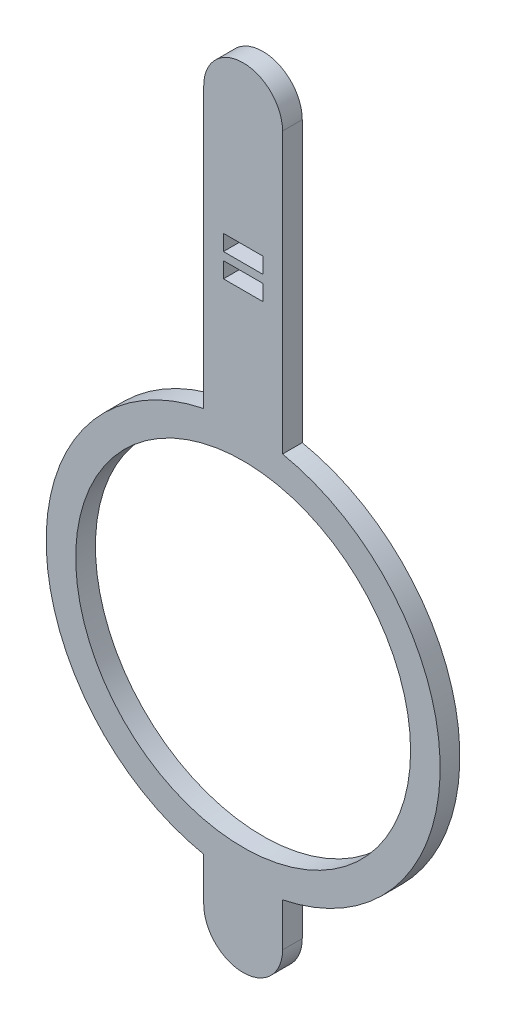
ISO-10303-21;
HEADER;
FILE_DESCRIPTION(('STEP AP214'),'2;1');
FILE_NAME('part.step','',(''),(''),'','','');
FILE_SCHEMA(('AUTOMOTIVE_DESIGN { 1 0 10303 214 1 1 1 1 }'));
ENDSEC;
DATA;
#1=APPLICATION_CONTEXT('core data for automotive mechanical design processes');
#2=APPLICATION_PROTOCOL_DEFINITION('international standard','automotive_design',2000,#1);
#3=PRODUCT_CONTEXT('',#1,'mechanical');
#4=PRODUCT('Part','Part','',(#3));
#5=PRODUCT_RELATED_PRODUCT_CATEGORY('part','',(#4));
#6=PRODUCT_DEFINITION_FORMATION('','',#4);
#7=PRODUCT_DEFINITION_CONTEXT('part definition',#1,'design');
#8=PRODUCT_DEFINITION('design','',#6,#7);
#9=PRODUCT_DEFINITION_SHAPE('','',#8);
#10=(LENGTH_UNIT() NAMED_UNIT(*) SI_UNIT(.MILLI.,.METRE.));
#11=(NAMED_UNIT(*) PLANE_ANGLE_UNIT() SI_UNIT($,.RADIAN.));
#12=(NAMED_UNIT(*) SI_UNIT($,.STERADIAN.) SOLID_ANGLE_UNIT());
#13=UNCERTAINTY_MEASURE_WITH_UNIT(LENGTH_MEASURE(1.E-05),#10,'distance_accuracy_value','');
#14=(GEOMETRIC_REPRESENTATION_CONTEXT(3) GLOBAL_UNCERTAINTY_ASSIGNED_CONTEXT((#13)) GLOBAL_UNIT_ASSIGNED_CONTEXT((#10,
#11,#12)) REPRESENTATION_CONTEXT('',''));
#15=CARTESIAN_POINT('',(0.,0.,0.));
#16=DIRECTION('',(0.,0.,1.));
#17=DIRECTION('',(1.,0.,0.));
#18=AXIS2_PLACEMENT_3D('',#15,#16,#17);
#19=CARTESIAN_POINT('',(0.,6.,0.25));
#20=DIRECTION('',(0.,0.,1.));
#21=DIRECTION('',(1.,0.,0.));
#22=AXIS2_PLACEMENT_3D('',#19,#20,#21);
#23=PLANE('',#22);
#24=DIRECTION('',(0.,-1.,0.));
#25=VECTOR('',#24,1.);
#26=CARTESIAN_POINT('',(0.25,4.2,0.25));
#27=LINE('',#26,#25);
#28=CARTESIAN_POINT('',(0.25,4.2,0.25));
#29=VERTEX_POINT('',#28);
#30=CARTESIAN_POINT('',(0.25,4.,0.25));
#31=VERTEX_POINT('',#30);
#32=EDGE_CURVE('E164',#29,#31,#27,.T.);
#33=ORIENTED_EDGE('',*,*,#32,.T.);
#34=DIRECTION('',(-1.,0.,0.));
#35=VECTOR('',#34,1.);
#36=CARTESIAN_POINT('',(0.25,4.,0.25));
#37=LINE('',#36,#35);
#38=CARTESIAN_POINT('',(-0.25,4.,0.25));
#39=VERTEX_POINT('',#38);
#40=EDGE_CURVE('E153',#31,#39,#37,.T.);
#41=ORIENTED_EDGE('',*,*,#40,.T.);
#42=DIRECTION('',(0.,1.,0.));
#43=VECTOR('',#42,1.);
#44=CARTESIAN_POINT('',(-0.25,4.2,0.25));
#45=LINE('',#44,#43);
#46=CARTESIAN_POINT('',(-0.25,4.2,0.25));
#47=VERTEX_POINT('',#46);
#48=EDGE_CURVE('E174',#39,#47,#45,.T.);
#49=ORIENTED_EDGE('',*,*,#48,.T.);
#50=DIRECTION('',(1.,0.,0.));
#51=VECTOR('',#50,1.);
#52=CARTESIAN_POINT('',(0.25,4.2,0.25));
#53=LINE('',#52,#51);
#54=EDGE_CURVE('E170',#47,#29,#53,.T.);
#55=ORIENTED_EDGE('',*,*,#54,.T.);
#56=EDGE_LOOP('',(#33,#41,#49,#55));
#57=FACE_BOUND('',#56,.T.);
#58=DIRECTION('',(0.,-1.,0.));
#59=VECTOR('',#58,1.);
#60=CARTESIAN_POINT('',(0.25,4.3,0.25));
#61=LINE('',#60,#59);
#62=CARTESIAN_POINT('',(0.25,4.5,0.25));
#63=VERTEX_POINT('',#62);
#64=CARTESIAN_POINT('',(0.25,4.3,0.25));
#65=VERTEX_POINT('',#64);
#66=EDGE_CURVE('E193',#63,#65,#61,.T.);
#67=ORIENTED_EDGE('',*,*,#66,.T.);
#68=DIRECTION('',(-1.,0.,0.));
#69=VECTOR('',#68,1.);
#70=CARTESIAN_POINT('',(0.25,4.3,0.25));
#71=LINE('',#70,#69);
#72=CARTESIAN_POINT('',(-0.25,4.3,0.25));
#73=VERTEX_POINT('',#72);
#74=EDGE_CURVE('E210',#65,#73,#71,.T.);
#75=ORIENTED_EDGE('',*,*,#74,.T.);
#76=DIRECTION('',(0.,1.,0.));
#77=VECTOR('',#76,1.);
#78=CARTESIAN_POINT('',(-0.25,4.3,0.25));
#79=LINE('',#78,#77);
#80=CARTESIAN_POINT('',(-0.25,4.5,0.25));
#81=VERTEX_POINT('',#80);
#82=EDGE_CURVE('E160',#73,#81,#79,.T.);
#83=ORIENTED_EDGE('',*,*,#82,.T.);
#84=DIRECTION('',(1.,0.,0.));
#85=VECTOR('',#84,1.);
#86=CARTESIAN_POINT('',(0.25,4.5,0.25));
#87=LINE('',#86,#85);
#88=EDGE_CURVE('E190',#81,#63,#87,.T.);
#89=ORIENTED_EDGE('',*,*,#88,.T.);
#90=EDGE_LOOP('',(#67,#75,#83,#89));
#91=FACE_BOUND('',#90,.T.);
#92=CARTESIAN_POINT('',(0.,6.,0.25));
#93=DIRECTION('',(0.,0.,1.));
#94=DIRECTION('',(1.,0.,0.));
#95=AXIS2_PLACEMENT_3D('',#92,#93,#94);
#96=CIRCLE('',#95,0.5);
#97=CARTESIAN_POINT('',(0.5,6.,0.25));
#98=VERTEX_POINT('',#97);
#99=CARTESIAN_POINT('',(-0.5,6.,0.25));
#100=VERTEX_POINT('',#99);
#101=EDGE_CURVE('E226',#98,#100,#96,.T.);
#102=ORIENTED_EDGE('',*,*,#101,.T.);
#103=DIRECTION('',(0.,-1.,0.));
#104=VECTOR('',#103,1.);
#105=CARTESIAN_POINT('',(-0.5,2.44948974278318,0.25));
#106=LINE('',#105,#104);
#107=CARTESIAN_POINT('',(-0.5,2.44948974278318,0.25));
#108=VERTEX_POINT('',#107);
#109=EDGE_CURVE('E229',#100,#108,#106,.T.);
#110=ORIENTED_EDGE('',*,*,#109,.T.);
#111=CARTESIAN_POINT('',(0.,0.,0.25));
#112=DIRECTION('',(0.,0.,1.));
#113=DIRECTION('',(1.,0.,0.));
#114=AXIS2_PLACEMENT_3D('',#111,#112,#113);
#115=CIRCLE('',#114,2.5);
#116=CARTESIAN_POINT('',(-0.5,-2.44948974278318,0.25));
#117=VERTEX_POINT('',#116);
#118=EDGE_CURVE('E232',#108,#117,#115,.T.);
#119=ORIENTED_EDGE('',*,*,#118,.T.);
#120=DIRECTION('',(0.,-1.,0.));
#121=VECTOR('',#120,1.);
#122=CARTESIAN_POINT('',(-0.5,-2.44948974278318,0.25));
#123=LINE('',#122,#121);
#124=CARTESIAN_POINT('',(-0.5,-3.,0.25));
#125=VERTEX_POINT('',#124);
#126=EDGE_CURVE('E234',#117,#125,#123,.T.);
#127=ORIENTED_EDGE('',*,*,#126,.T.);
#128=CARTESIAN_POINT('',(0.,-3.,0.25));
#129=DIRECTION('',(0.,0.,1.));
#130=DIRECTION('',(1.,0.,0.));
#131=AXIS2_PLACEMENT_3D('',#128,#129,#130);
#132=CIRCLE('',#131,0.5);
#133=CARTESIAN_POINT('',(0.5,-3.,0.25));
#134=VERTEX_POINT('',#133);
#135=EDGE_CURVE('E236',#125,#134,#132,.T.);
#136=ORIENTED_EDGE('',*,*,#135,.T.);
#137=DIRECTION('',(0.,1.,0.));
#138=VECTOR('',#137,1.);
#139=CARTESIAN_POINT('',(0.5,-2.44948974278318,0.25));
#140=LINE('',#139,#138);
#141=CARTESIAN_POINT('',(0.5,-2.44948974278318,0.25));
#142=VERTEX_POINT('',#141);
#143=EDGE_CURVE('E238',#134,#142,#140,.T.);
#144=ORIENTED_EDGE('',*,*,#143,.T.);
#145=CARTESIAN_POINT('',(0.,0.,0.25));
#146=DIRECTION('',(0.,0.,1.));
#147=DIRECTION('',(1.,0.,0.));
#148=AXIS2_PLACEMENT_3D('',#145,#146,#147);
#149=CIRCLE('',#148,2.5);
#150=CARTESIAN_POINT('',(0.5,2.44948974278318,0.25));
#151=VERTEX_POINT('',#150);
#152=EDGE_CURVE('E240',#142,#151,#149,.T.);
#153=ORIENTED_EDGE('',*,*,#152,.T.);
#154=DIRECTION('',(0.,1.,0.));
#155=VECTOR('',#154,1.);
#156=CARTESIAN_POINT('',(0.5,2.44948974278318,0.25));
#157=LINE('',#156,#155);
#158=EDGE_CURVE('E242',#151,#98,#157,.T.);
#159=ORIENTED_EDGE('',*,*,#158,.T.);
#160=EDGE_LOOP('',(#102,#110,#119,#127,#136,#144,#153,#159));
#161=FACE_BOUND('',#160,.T.);
#162=CARTESIAN_POINT('',(0.,0.,0.25));
#163=DIRECTION('',(0.,0.,1.));
#164=DIRECTION('',(1.,0.,0.));
#165=AXIS2_PLACEMENT_3D('',#162,#163,#164);
#166=CIRCLE('',#165,2.125);
#167=CARTESIAN_POINT('',(2.125,0.,0.25));
#168=VERTEX_POINT('',#167);
#169=EDGE_CURVE('E220',#168,#168,#166,.T.);
#170=ORIENTED_EDGE('',*,*,#169,.F.);
#171=EDGE_LOOP('',(#170));
#172=FACE_BOUND('',#171,.T.);
#173=ADVANCED_FACE('F41',(#57,#91,#161,#172),#23,.T.);
#174=CARTESIAN_POINT('',(0.,6.,0.));
#175=DIRECTION('',(0.,0.,1.));
#176=DIRECTION('',(1.,0.,0.));
#177=AXIS2_PLACEMENT_3D('',#174,#175,#176);
#178=PLANE('',#177);
#179=DIRECTION('',(-1.,0.,0.));
#180=VECTOR('',#179,1.);
#181=CARTESIAN_POINT('',(0.25,4.,0.));
#182=LINE('',#181,#180);
#183=CARTESIAN_POINT('',(0.25,4.,0.));
#184=VERTEX_POINT('',#183);
#185=CARTESIAN_POINT('',(-0.25,4.,0.));
#186=VERTEX_POINT('',#185);
#187=EDGE_CURVE('E172',#184,#186,#182,.T.);
#188=ORIENTED_EDGE('',*,*,#187,.F.);
#189=DIRECTION('',(0.,-1.,0.));
#190=VECTOR('',#189,1.);
#191=CARTESIAN_POINT('',(0.25,4.2,0.));
#192=LINE('',#191,#190);
#193=CARTESIAN_POINT('',(0.25,4.2,0.));
#194=VERTEX_POINT('',#193);
#195=EDGE_CURVE('E64',#194,#184,#192,.T.);
#196=ORIENTED_EDGE('',*,*,#195,.F.);
#197=DIRECTION('',(1.,0.,0.));
#198=VECTOR('',#197,1.);
#199=CARTESIAN_POINT('',(0.25,4.2,0.));
#200=LINE('',#199,#198);
#201=CARTESIAN_POINT('',(-0.25,4.2,0.));
#202=VERTEX_POINT('',#201);
#203=EDGE_CURVE('E166',#202,#194,#200,.T.);
#204=ORIENTED_EDGE('',*,*,#203,.F.);
#205=DIRECTION('',(0.,1.,0.));
#206=VECTOR('',#205,1.);
#207=CARTESIAN_POINT('',(-0.25,4.2,0.));
#208=LINE('',#207,#206);
#209=EDGE_CURVE('E179',#186,#202,#208,.T.);
#210=ORIENTED_EDGE('',*,*,#209,.F.);
#211=EDGE_LOOP('',(#188,#196,#204,#210));
#212=FACE_BOUND('',#211,.T.);
#213=DIRECTION('',(-1.,0.,0.));
#214=VECTOR('',#213,1.);
#215=CARTESIAN_POINT('',(0.25,4.3,0.));
#216=LINE('',#215,#214);
#217=CARTESIAN_POINT('',(0.25,4.3,0.));
#218=VERTEX_POINT('',#217);
#219=CARTESIAN_POINT('',(-0.25,4.3,0.));
#220=VERTEX_POINT('',#219);
#221=EDGE_CURVE('E198',#218,#220,#216,.T.);
#222=ORIENTED_EDGE('',*,*,#221,.F.);
#223=DIRECTION('',(0.,-1.,0.));
#224=VECTOR('',#223,1.);
#225=CARTESIAN_POINT('',(0.25,4.3,0.));
#226=LINE('',#225,#224);
#227=CARTESIAN_POINT('',(0.25,4.5,0.));
#228=VERTEX_POINT('',#227);
#229=EDGE_CURVE('E196',#228,#218,#226,.T.);
#230=ORIENTED_EDGE('',*,*,#229,.F.);
#231=DIRECTION('',(1.,0.,0.));
#232=VECTOR('',#231,1.);
#233=CARTESIAN_POINT('',(0.25,4.5,0.));
#234=LINE('',#233,#232);
#235=CARTESIAN_POINT('',(-0.25,4.5,0.));
#236=VERTEX_POINT('',#235);
#237=EDGE_CURVE('E204',#236,#228,#234,.T.);
#238=ORIENTED_EDGE('',*,*,#237,.F.);
#239=DIRECTION('',(0.,1.,0.));
#240=VECTOR('',#239,1.);
#241=CARTESIAN_POINT('',(-0.25,4.3,0.));
#242=LINE('',#241,#240);
#243=EDGE_CURVE('E201',#220,#236,#242,.T.);
#244=ORIENTED_EDGE('',*,*,#243,.F.);
#245=EDGE_LOOP('',(#222,#230,#238,#244));
#246=FACE_BOUND('',#245,.T.);
#247=CARTESIAN_POINT('',(0.,6.,0.));
#248=DIRECTION('',(0.,0.,1.));
#249=DIRECTION('',(1.,0.,0.));
#250=AXIS2_PLACEMENT_3D('',#247,#248,#249);
#251=CIRCLE('',#250,0.5);
#252=CARTESIAN_POINT('',(0.5,6.,0.));
#253=VERTEX_POINT('',#252);
#254=CARTESIAN_POINT('',(-0.5,6.,0.));
#255=VERTEX_POINT('',#254);
#256=EDGE_CURVE('E223',#253,#255,#251,.T.);
#257=ORIENTED_EDGE('',*,*,#256,.F.);
#258=DIRECTION('',(0.,1.,0.));
#259=VECTOR('',#258,1.);
#260=CARTESIAN_POINT('',(0.5,2.44948974278318,0.));
#261=LINE('',#260,#259);
#262=CARTESIAN_POINT('',(0.5,2.44948974278318,0.));
#263=VERTEX_POINT('',#262);
#264=EDGE_CURVE('E230',#263,#253,#261,.T.);
#265=ORIENTED_EDGE('',*,*,#264,.F.);
#266=CARTESIAN_POINT('',(0.,0.,0.));
#267=DIRECTION('',(0.,0.,1.));
#268=DIRECTION('',(1.,0.,0.));
#269=AXIS2_PLACEMENT_3D('',#266,#267,#268);
#270=CIRCLE('',#269,2.5);
#271=CARTESIAN_POINT('',(0.5,-2.44948974278318,0.));
#272=VERTEX_POINT('',#271);
#273=EDGE_CURVE('E257',#272,#263,#270,.T.);
#274=ORIENTED_EDGE('',*,*,#273,.F.);
#275=DIRECTION('',(0.,1.,0.));
#276=VECTOR('',#275,1.);
#277=CARTESIAN_POINT('',(0.5,-2.44948974278318,0.));
#278=LINE('',#277,#276);
#279=CARTESIAN_POINT('',(0.5,-3.,0.));
#280=VERTEX_POINT('',#279);
#281=EDGE_CURVE('E255',#280,#272,#278,.T.);
#282=ORIENTED_EDGE('',*,*,#281,.F.);
#283=CARTESIAN_POINT('',(0.,-3.,0.));
#284=DIRECTION('',(0.,0.,1.));
#285=DIRECTION('',(1.,0.,0.));
#286=AXIS2_PLACEMENT_3D('',#283,#284,#285);
#287=CIRCLE('',#286,0.5);
#288=CARTESIAN_POINT('',(-0.5,-3.,0.));
#289=VERTEX_POINT('',#288);
#290=EDGE_CURVE('E253',#289,#280,#287,.T.);
#291=ORIENTED_EDGE('',*,*,#290,.F.);
#292=DIRECTION('',(0.,-1.,0.));
#293=VECTOR('',#292,1.);
#294=CARTESIAN_POINT('',(-0.5,-2.44948974278318,0.));
#295=LINE('',#294,#293);
#296=CARTESIAN_POINT('',(-0.5,-2.44948974278318,0.));
#297=VERTEX_POINT('',#296);
#298=EDGE_CURVE('E251',#297,#289,#295,.T.);
#299=ORIENTED_EDGE('',*,*,#298,.F.);
#300=CARTESIAN_POINT('',(0.,0.,0.));
#301=DIRECTION('',(0.,0.,1.));
#302=DIRECTION('',(1.,0.,0.));
#303=AXIS2_PLACEMENT_3D('',#300,#301,#302);
#304=CIRCLE('',#303,2.5);
#305=CARTESIAN_POINT('',(-0.5,2.44948974278318,0.));
#306=VERTEX_POINT('',#305);
#307=EDGE_CURVE('E249',#306,#297,#304,.T.);
#308=ORIENTED_EDGE('',*,*,#307,.F.);
#309=DIRECTION('',(0.,-1.,0.));
#310=VECTOR('',#309,1.);
#311=CARTESIAN_POINT('',(-0.5,2.44948974278318,0.));
#312=LINE('',#311,#310);
#313=EDGE_CURVE('E247',#255,#306,#312,.T.);
#314=ORIENTED_EDGE('',*,*,#313,.F.);
#315=EDGE_LOOP('',(#257,#265,#274,#282,#291,#299,#308,#314));
#316=FACE_BOUND('',#315,.T.);
#317=CARTESIAN_POINT('',(0.,0.,0.));
#318=DIRECTION('',(0.,0.,1.));
#319=DIRECTION('',(1.,0.,0.));
#320=AXIS2_PLACEMENT_3D('',#317,#318,#319);
#321=CIRCLE('',#320,2.125);
#322=CARTESIAN_POINT('',(2.125,0.,0.));
#323=VERTEX_POINT('',#322);
#324=EDGE_CURVE('E219',#323,#323,#321,.T.);
#325=ORIENTED_EDGE('',*,*,#324,.T.);
#326=EDGE_LOOP('',(#325));
#327=FACE_BOUND('',#326,.T.);
#328=ADVANCED_FACE('F287',(#212,#246,#316,#327),#178,.F.);
#329=CARTESIAN_POINT('',(0.,6.,0.25));
#330=DIRECTION('',(0.,0.,-1.));
#331=DIRECTION('',(-1.,0.,0.));
#332=AXIS2_PLACEMENT_3D('',#329,#330,#331);
#333=CYLINDRICAL_SURFACE('',#332,0.5);
#334=ORIENTED_EDGE('',*,*,#256,.T.);
#335=DIRECTION('',(0.,0.,-1.));
#336=VECTOR('',#335,1.);
#337=CARTESIAN_POINT('',(-0.5,6.,0.25));
#338=LINE('',#337,#336);
#339=EDGE_CURVE('E11',#100,#255,#338,.T.);
#340=ORIENTED_EDGE('',*,*,#339,.F.);
#341=ORIENTED_EDGE('',*,*,#101,.F.);
#342=DIRECTION('',(0.,0.,-1.));
#343=VECTOR('',#342,1.);
#344=CARTESIAN_POINT('',(0.5,6.,0.25));
#345=LINE('',#344,#343);
#346=EDGE_CURVE('E244',#98,#253,#345,.T.);
#347=ORIENTED_EDGE('',*,*,#346,.T.);
#348=EDGE_LOOP('',(#334,#340,#341,#347));
#349=FACE_BOUND('',#348,.T.);
#350=ADVANCED_FACE('F43',(#349),#333,.T.);
#351=CARTESIAN_POINT('',(-0.5,2.44948974278318,0.25));
#352=DIRECTION('',(1.,0.,0.));
#353=DIRECTION('',(0.,0.,-1.));
#354=AXIS2_PLACEMENT_3D('',#351,#352,#353);
#355=PLANE('',#354);
#356=ORIENTED_EDGE('',*,*,#313,.T.);
#357=DIRECTION('',(0.,0.,-1.));
#358=VECTOR('',#357,1.);
#359=CARTESIAN_POINT('',(-0.5,2.44948974278318,0.25));
#360=LINE('',#359,#358);
#361=EDGE_CURVE('E49',#108,#306,#360,.T.);
#362=ORIENTED_EDGE('',*,*,#361,.F.);
#363=ORIENTED_EDGE('',*,*,#109,.F.);
#364=ORIENTED_EDGE('',*,*,#339,.T.);
#365=EDGE_LOOP('',(#356,#362,#363,#364));
#366=FACE_BOUND('',#365,.T.);
#367=ADVANCED_FACE('F305',(#366),#355,.F.);
#368=CARTESIAN_POINT('',(0.,0.,0.25));
#369=DIRECTION('',(0.,0.,-1.));
#370=DIRECTION('',(-1.,0.,0.));
#371=AXIS2_PLACEMENT_3D('',#368,#369,#370);
#372=CYLINDRICAL_SURFACE('',#371,2.5);
#373=ORIENTED_EDGE('',*,*,#307,.T.);
#374=DIRECTION('',(0.,0.,-1.));
#375=VECTOR('',#374,1.);
#376=CARTESIAN_POINT('',(-0.5,-2.44948974278318,0.25));
#377=LINE('',#376,#375);
#378=EDGE_CURVE('E274',#117,#297,#377,.T.);
#379=ORIENTED_EDGE('',*,*,#378,.F.);
#380=ORIENTED_EDGE('',*,*,#118,.F.);
#381=ORIENTED_EDGE('',*,*,#361,.T.);
#382=EDGE_LOOP('',(#373,#379,#380,#381));
#383=FACE_BOUND('',#382,.T.);
#384=ADVANCED_FACE('F281',(#383),#372,.T.);
#385=CARTESIAN_POINT('',(-0.5,-2.44948974278318,0.25));
#386=DIRECTION('',(1.,0.,0.));
#387=DIRECTION('',(0.,0.,-1.));
#388=AXIS2_PLACEMENT_3D('',#385,#386,#387);
#389=PLANE('',#388);
#390=ORIENTED_EDGE('',*,*,#298,.T.);
#391=DIRECTION('',(0.,0.,-1.));
#392=VECTOR('',#391,1.);
#393=CARTESIAN_POINT('',(-0.5,-3.,0.25));
#394=LINE('',#393,#392);
#395=EDGE_CURVE('E271',#125,#289,#394,.T.);
#396=ORIENTED_EDGE('',*,*,#395,.F.);
#397=ORIENTED_EDGE('',*,*,#126,.F.);
#398=ORIENTED_EDGE('',*,*,#378,.T.);
#399=EDGE_LOOP('',(#390,#396,#397,#398));
#400=FACE_BOUND('',#399,.T.);
#401=ADVANCED_FACE('F293',(#400),#389,.F.);
#402=CARTESIAN_POINT('',(0.,-3.,0.25));
#403=DIRECTION('',(0.,0.,-1.));
#404=DIRECTION('',(-1.,0.,0.));
#405=AXIS2_PLACEMENT_3D('',#402,#403,#404);
#406=CYLINDRICAL_SURFACE('',#405,0.5);
#407=ORIENTED_EDGE('',*,*,#290,.T.);
#408=DIRECTION('',(0.,0.,-1.));
#409=VECTOR('',#408,1.);
#410=CARTESIAN_POINT('',(0.5,-3.,0.25));
#411=LINE('',#410,#409);
#412=EDGE_CURVE('E268',#134,#280,#411,.T.);
#413=ORIENTED_EDGE('',*,*,#412,.F.);
#414=ORIENTED_EDGE('',*,*,#135,.F.);
#415=ORIENTED_EDGE('',*,*,#395,.T.);
#416=EDGE_LOOP('',(#407,#413,#414,#415));
#417=FACE_BOUND('',#416,.T.);
#418=ADVANCED_FACE('F297',(#417),#406,.T.);
#419=CARTESIAN_POINT('',(0.5,-2.44948974278318,0.25));
#420=DIRECTION('',(-1.,0.,0.));
#421=DIRECTION('',(0.,-1.,0.));
#422=AXIS2_PLACEMENT_3D('',#419,#420,#421);
#423=PLANE('',#422);
#424=ORIENTED_EDGE('',*,*,#281,.T.);
#425=DIRECTION('',(0.,0.,-1.));
#426=VECTOR('',#425,1.);
#427=CARTESIAN_POINT('',(0.5,-2.44948974278318,0.25));
#428=LINE('',#427,#426);
#429=EDGE_CURVE('E265',#142,#272,#428,.T.);
#430=ORIENTED_EDGE('',*,*,#429,.F.);
#431=ORIENTED_EDGE('',*,*,#143,.F.);
#432=ORIENTED_EDGE('',*,*,#412,.T.);
#433=EDGE_LOOP('',(#424,#430,#431,#432));
#434=FACE_BOUND('',#433,.T.);
#435=ADVANCED_FACE('F318',(#434),#423,.F.);
#436=CARTESIAN_POINT('',(0.,0.,0.25));
#437=DIRECTION('',(0.,0.,-1.));
#438=DIRECTION('',(-1.,0.,0.));
#439=AXIS2_PLACEMENT_3D('',#436,#437,#438);
#440=CYLINDRICAL_SURFACE('',#439,2.5);
#441=ORIENTED_EDGE('',*,*,#273,.T.);
#442=DIRECTION('',(0.,0.,-1.));
#443=VECTOR('',#442,1.);
#444=CARTESIAN_POINT('',(0.5,2.44948974278318,0.25));
#445=LINE('',#444,#443);
#446=EDGE_CURVE('E262',#151,#263,#445,.T.);
#447=ORIENTED_EDGE('',*,*,#446,.F.);
#448=ORIENTED_EDGE('',*,*,#152,.F.);
#449=ORIENTED_EDGE('',*,*,#429,.T.);
#450=EDGE_LOOP('',(#441,#447,#448,#449));
#451=FACE_BOUND('',#450,.T.);
#452=ADVANCED_FACE('F316',(#451),#440,.T.);
#453=CARTESIAN_POINT('',(0.5,2.44948974278318,0.25));
#454=DIRECTION('',(-1.,0.,0.));
#455=DIRECTION('',(0.,0.,1.));
#456=AXIS2_PLACEMENT_3D('',#453,#454,#455);
#457=PLANE('',#456);
#458=ORIENTED_EDGE('',*,*,#264,.T.);
#459=ORIENTED_EDGE('',*,*,#346,.F.);
#460=ORIENTED_EDGE('',*,*,#158,.F.);
#461=ORIENTED_EDGE('',*,*,#446,.T.);
#462=EDGE_LOOP('',(#458,#459,#460,#461));
#463=FACE_BOUND('',#462,.T.);
#464=ADVANCED_FACE('F311',(#463),#457,.F.);
#465=CARTESIAN_POINT('',(0.,0.,0.25));
#466=DIRECTION('',(0.,0.,-1.));
#467=DIRECTION('',(-1.,0.,0.));
#468=AXIS2_PLACEMENT_3D('',#465,#466,#467);
#469=CYLINDRICAL_SURFACE('',#468,2.125);
#470=ORIENTED_EDGE('',*,*,#324,.F.);
#471=EDGE_LOOP('',(#470));
#472=FACE_BOUND('',#471,.T.);
#473=ORIENTED_EDGE('',*,*,#169,.T.);
#474=EDGE_LOOP('',(#473));
#475=FACE_BOUND('',#474,.T.);
#476=ADVANCED_FACE('F335',(#472,#475),#469,.F.);
#477=CARTESIAN_POINT('',(0.25,4.3,0.251));
#478=DIRECTION('',(1.,0.,0.));
#479=DIRECTION('',(0.,0.,-1.));
#480=AXIS2_PLACEMENT_3D('',#477,#478,#479);
#481=PLANE('',#480);
#482=DIRECTION('',(0.,0.,-1.));
#483=VECTOR('',#482,1.);
#484=CARTESIAN_POINT('',(0.25,4.5,0.251));
#485=LINE('',#484,#483);
#486=EDGE_CURVE('E208',#63,#228,#485,.T.);
#487=ORIENTED_EDGE('',*,*,#486,.T.);
#488=ORIENTED_EDGE('',*,*,#229,.T.);
#489=DIRECTION('',(0.,0.,-1.));
#490=VECTOR('',#489,1.);
#491=CARTESIAN_POINT('',(0.25,4.3,0.251));
#492=LINE('',#491,#490);
#493=EDGE_CURVE('E207',#65,#218,#492,.T.);
#494=ORIENTED_EDGE('',*,*,#493,.F.);
#495=ORIENTED_EDGE('',*,*,#66,.F.);
#496=EDGE_LOOP('',(#487,#488,#494,#495));
#497=FACE_BOUND('',#496,.T.);
#498=ADVANCED_FACE('F342',(#497),#481,.F.);
#499=CARTESIAN_POINT('',(0.25,4.5,0.251));
#500=DIRECTION('',(0.,1.,0.));
#501=DIRECTION('',(0.,0.,1.));
#502=AXIS2_PLACEMENT_3D('',#499,#500,#501);
#503=PLANE('',#502);
#504=DIRECTION('',(0.,0.,-1.));
#505=VECTOR('',#504,1.);
#506=CARTESIAN_POINT('',(-0.25,4.5,0.251));
#507=LINE('',#506,#505);
#508=EDGE_CURVE('E211',#81,#236,#507,.T.);
#509=ORIENTED_EDGE('',*,*,#508,.T.);
#510=ORIENTED_EDGE('',*,*,#237,.T.);
#511=ORIENTED_EDGE('',*,*,#486,.F.);
#512=ORIENTED_EDGE('',*,*,#88,.F.);
#513=EDGE_LOOP('',(#509,#510,#511,#512));
#514=FACE_BOUND('',#513,.T.);
#515=ADVANCED_FACE('F347',(#514),#503,.F.);
#516=CARTESIAN_POINT('',(-0.25,4.3,0.251));
#517=DIRECTION('',(-1.,0.,0.));
#518=DIRECTION('',(0.,0.,1.));
#519=AXIS2_PLACEMENT_3D('',#516,#517,#518);
#520=PLANE('',#519);
#521=DIRECTION('',(0.,0.,-1.));
#522=VECTOR('',#521,1.);
#523=CARTESIAN_POINT('',(-0.25,4.3,0.251));
#524=LINE('',#523,#522);
#525=EDGE_CURVE('E213',#73,#220,#524,.T.);
#526=ORIENTED_EDGE('',*,*,#525,.T.);
#527=ORIENTED_EDGE('',*,*,#243,.T.);
#528=ORIENTED_EDGE('',*,*,#508,.F.);
#529=ORIENTED_EDGE('',*,*,#82,.F.);
#530=EDGE_LOOP('',(#526,#527,#528,#529));
#531=FACE_BOUND('',#530,.T.);
#532=ADVANCED_FACE('F355',(#531),#520,.F.);
#533=CARTESIAN_POINT('',(0.25,4.3,0.251));
#534=DIRECTION('',(0.,-1.,0.));
#535=DIRECTION('',(0.,0.,-1.));
#536=AXIS2_PLACEMENT_3D('',#533,#534,#535);
#537=PLANE('',#536);
#538=ORIENTED_EDGE('',*,*,#493,.T.);
#539=ORIENTED_EDGE('',*,*,#221,.T.);
#540=ORIENTED_EDGE('',*,*,#525,.F.);
#541=ORIENTED_EDGE('',*,*,#74,.F.);
#542=EDGE_LOOP('',(#538,#539,#540,#541));
#543=FACE_BOUND('',#542,.T.);
#544=ADVANCED_FACE('F359',(#543),#537,.F.);
#545=CARTESIAN_POINT('',(0.25,4.2,0.251));
#546=DIRECTION('',(1.,0.,0.));
#547=DIRECTION('',(0.,0.,-1.));
#548=AXIS2_PLACEMENT_3D('',#545,#546,#547);
#549=PLANE('',#548);
#550=DIRECTION('',(0.,0.,-1.));
#551=VECTOR('',#550,1.);
#552=CARTESIAN_POINT('',(0.25,4.2,0.251));
#553=LINE('',#552,#551);
#554=EDGE_CURVE('E161',#29,#194,#553,.T.);
#555=ORIENTED_EDGE('',*,*,#554,.T.);
#556=ORIENTED_EDGE('',*,*,#195,.T.);
#557=DIRECTION('',(0.,0.,-1.));
#558=VECTOR('',#557,1.);
#559=CARTESIAN_POINT('',(0.25,4.,0.251));
#560=LINE('',#559,#558);
#561=EDGE_CURVE('E155',#31,#184,#560,.T.);
#562=ORIENTED_EDGE('',*,*,#561,.F.);
#563=ORIENTED_EDGE('',*,*,#32,.F.);
#564=EDGE_LOOP('',(#555,#556,#562,#563));
#565=FACE_BOUND('',#564,.T.);
#566=ADVANCED_FACE('F163',(#565),#549,.F.);
#567=CARTESIAN_POINT('',(0.25,4.2,0.251));
#568=DIRECTION('',(0.,1.,0.));
#569=DIRECTION('',(0.,0.,1.));
#570=AXIS2_PLACEMENT_3D('',#567,#568,#569);
#571=PLANE('',#570);
#572=DIRECTION('',(0.,0.,-1.));
#573=VECTOR('',#572,1.);
#574=CARTESIAN_POINT('',(-0.25,4.2,0.251));
#575=LINE('',#574,#573);
#576=EDGE_CURVE('E185',#47,#202,#575,.T.);
#577=ORIENTED_EDGE('',*,*,#576,.T.);
#578=ORIENTED_EDGE('',*,*,#203,.T.);
#579=ORIENTED_EDGE('',*,*,#554,.F.);
#580=ORIENTED_EDGE('',*,*,#54,.F.);
#581=EDGE_LOOP('',(#577,#578,#579,#580));
#582=FACE_BOUND('',#581,.T.);
#583=ADVANCED_FACE('F368',(#582),#571,.F.);
#584=CARTESIAN_POINT('',(-0.25,4.2,0.251));
#585=DIRECTION('',(-1.,0.,0.));
#586=DIRECTION('',(0.,0.,1.));
#587=AXIS2_PLACEMENT_3D('',#584,#585,#586);
#588=PLANE('',#587);
#589=DIRECTION('',(0.,0.,-1.));
#590=VECTOR('',#589,1.);
#591=CARTESIAN_POINT('',(-0.25,4.,0.251));
#592=LINE('',#591,#590);
#593=EDGE_CURVE('E56',#39,#186,#592,.T.);
#594=ORIENTED_EDGE('',*,*,#593,.T.);
#595=ORIENTED_EDGE('',*,*,#209,.T.);
#596=ORIENTED_EDGE('',*,*,#576,.F.);
#597=ORIENTED_EDGE('',*,*,#48,.F.);
#598=EDGE_LOOP('',(#594,#595,#596,#597));
#599=FACE_BOUND('',#598,.T.);
#600=ADVANCED_FACE('F371',(#599),#588,.F.);
#601=CARTESIAN_POINT('',(0.25,4.,0.251));
#602=DIRECTION('',(0.,-1.,0.));
#603=DIRECTION('',(0.,0.,-1.));
#604=AXIS2_PLACEMENT_3D('',#601,#602,#603);
#605=PLANE('',#604);
#606=ORIENTED_EDGE('',*,*,#561,.T.);
#607=ORIENTED_EDGE('',*,*,#187,.T.);
#608=ORIENTED_EDGE('',*,*,#593,.F.);
#609=ORIENTED_EDGE('',*,*,#40,.F.);
#610=EDGE_LOOP('',(#606,#607,#608,#609));
#611=FACE_BOUND('',#610,.T.);
#612=ADVANCED_FACE('F154',(#611),#605,.F.);
#613=CLOSED_SHELL('',(#173,#328,#350,#367,#384,#401,#418,#435,#452,#464,#476,#498,#515,#532,
#544,#566,#583,#600,#612));
#614=MANIFOLD_SOLID_BREP('B2',#613);
#615=ADVANCED_BREP_SHAPE_REPRESENTATION('',(#18,#614),#14);
#616=SHAPE_DEFINITION_REPRESENTATION(#9,#615);
ENDSEC;
END-ISO-10303-21;
